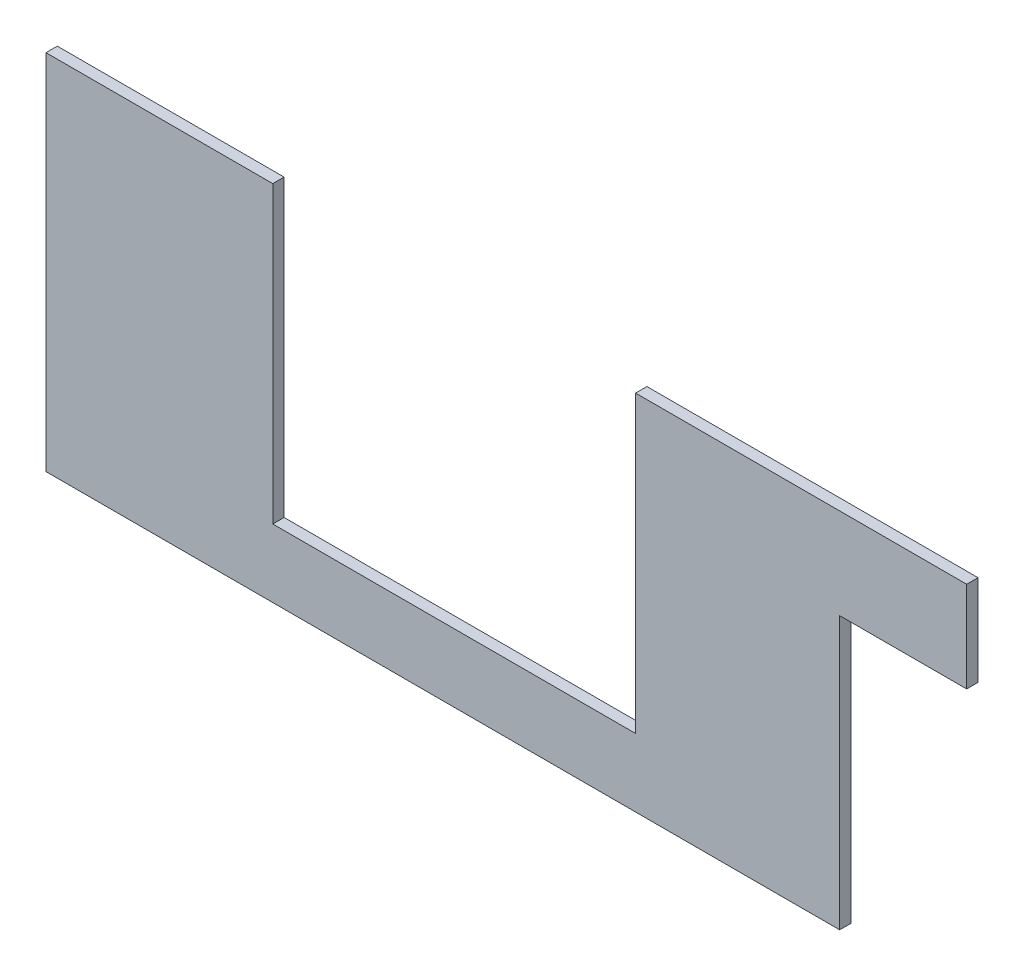
ISO-10303-21;
HEADER;
FILE_DESCRIPTION(('STEP AP214'),'2;1');
FILE_NAME('part.step','',(''),(''),'','','');
FILE_SCHEMA(('AUTOMOTIVE_DESIGN { 1 0 10303 214 1 1 1 1 }'));
ENDSEC;
DATA;
#1=APPLICATION_CONTEXT('core data for automotive mechanical design processes');
#2=APPLICATION_PROTOCOL_DEFINITION('international standard','automotive_design',2000,#1);
#3=PRODUCT_CONTEXT('',#1,'mechanical');
#4=PRODUCT('Part','Part','',(#3));
#5=PRODUCT_RELATED_PRODUCT_CATEGORY('part','',(#4));
#6=PRODUCT_DEFINITION_FORMATION('','',#4);
#7=PRODUCT_DEFINITION_CONTEXT('part definition',#1,'design');
#8=PRODUCT_DEFINITION('design','',#6,#7);
#9=PRODUCT_DEFINITION_SHAPE('','',#8);
#10=(LENGTH_UNIT() NAMED_UNIT(*) SI_UNIT(.MILLI.,.METRE.));
#11=(NAMED_UNIT(*) PLANE_ANGLE_UNIT() SI_UNIT($,.RADIAN.));
#12=(NAMED_UNIT(*) SI_UNIT($,.STERADIAN.) SOLID_ANGLE_UNIT());
#13=UNCERTAINTY_MEASURE_WITH_UNIT(LENGTH_MEASURE(1.E-05),#10,'distance_accuracy_value','');
#14=(GEOMETRIC_REPRESENTATION_CONTEXT(3) GLOBAL_UNCERTAINTY_ASSIGNED_CONTEXT((#13)) GLOBAL_UNIT_ASSIGNED_CONTEXT((#10,
#11,#12)) REPRESENTATION_CONTEXT('',''));
#15=CARTESIAN_POINT('',(0.,0.,0.));
#16=DIRECTION('',(0.,0.,1.));
#17=DIRECTION('',(1.,0.,0.));
#18=AXIS2_PLACEMENT_3D('',#15,#16,#17);
#19=CARTESIAN_POINT('',(0.,0.,3.175));
#20=DIRECTION('',(1.,0.,0.));
#21=DIRECTION('',(0.,0.,-1.));
#22=AXIS2_PLACEMENT_3D('',#19,#20,#21);
#23=PLANE('',#22);
#24=DIRECTION('',(0.,-1.,0.));
#25=VECTOR('',#24,1.);
#26=CARTESIAN_POINT('',(0.,0.,0.));
#27=LINE('',#26,#25);
#28=CARTESIAN_POINT('',(0.,101.6,0.));
#29=VERTEX_POINT('',#28);
#30=CARTESIAN_POINT('',(0.,0.,0.));
#31=VERTEX_POINT('',#30);
#32=EDGE_CURVE('E155',#29,#31,#27,.T.);
#33=ORIENTED_EDGE('',*,*,#32,.T.);
#34=DIRECTION('',(0.,0.,-1.));
#35=VECTOR('',#34,1.);
#36=CARTESIAN_POINT('',(0.,0.,3.175));
#37=LINE('',#36,#35);
#38=CARTESIAN_POINT('',(0.,0.,3.175));
#39=VERTEX_POINT('',#38);
#40=EDGE_CURVE('E11',#39,#31,#37,.T.);
#41=ORIENTED_EDGE('',*,*,#40,.F.);
#42=DIRECTION('',(0.,-1.,0.));
#43=VECTOR('',#42,1.);
#44=CARTESIAN_POINT('',(0.,0.,3.175));
#45=LINE('',#44,#43);
#46=CARTESIAN_POINT('',(0.,101.6,3.175));
#47=VERTEX_POINT('',#46);
#48=EDGE_CURVE('E183',#47,#39,#45,.T.);
#49=ORIENTED_EDGE('',*,*,#48,.F.);
#50=DIRECTION('',(0.,0.,-1.));
#51=VECTOR('',#50,1.);
#52=CARTESIAN_POINT('',(0.,101.6,3.175));
#53=LINE('',#52,#51);
#54=EDGE_CURVE('E151',#47,#29,#53,.T.);
#55=ORIENTED_EDGE('',*,*,#54,.T.);
#56=EDGE_LOOP('',(#33,#41,#49,#55));
#57=FACE_BOUND('',#56,.T.);
#58=ADVANCED_FACE('F42',(#57),#23,.F.);
#59=CARTESIAN_POINT('',(0.,0.,3.175));
#60=DIRECTION('',(0.,1.,0.));
#61=DIRECTION('',(0.,0.,1.));
#62=AXIS2_PLACEMENT_3D('',#59,#60,#61);
#63=PLANE('',#62);
#64=DIRECTION('',(1.,0.,0.));
#65=VECTOR('',#64,1.);
#66=CARTESIAN_POINT('',(0.,0.,0.));
#67=LINE('',#66,#65);
#68=CARTESIAN_POINT('',(222.25,0.,0.));
#69=VERTEX_POINT('',#68);
#70=EDGE_CURVE('E159',#31,#69,#67,.T.);
#71=ORIENTED_EDGE('',*,*,#70,.T.);
#72=DIRECTION('',(0.,0.,-1.));
#73=VECTOR('',#72,1.);
#74=CARTESIAN_POINT('',(222.25,0.,3.175));
#75=LINE('',#74,#73);
#76=CARTESIAN_POINT('',(222.25,0.,3.175));
#77=VERTEX_POINT('',#76);
#78=EDGE_CURVE('E51',#77,#69,#75,.T.);
#79=ORIENTED_EDGE('',*,*,#78,.F.);
#80=DIRECTION('',(1.,0.,0.));
#81=VECTOR('',#80,1.);
#82=CARTESIAN_POINT('',(0.,0.,3.175));
#83=LINE('',#82,#81);
#84=EDGE_CURVE('E108',#39,#77,#83,.T.);
#85=ORIENTED_EDGE('',*,*,#84,.F.);
#86=ORIENTED_EDGE('',*,*,#40,.T.);
#87=EDGE_LOOP('',(#71,#79,#85,#86));
#88=FACE_BOUND('',#87,.T.);
#89=ADVANCED_FACE('F247',(#88),#63,.F.);
#90=CARTESIAN_POINT('',(222.25,76.2,3.175));
#91=DIRECTION('',(-1.,0.,0.));
#92=DIRECTION('',(0.,0.,1.));
#93=AXIS2_PLACEMENT_3D('',#90,#91,#92);
#94=PLANE('',#93);
#95=DIRECTION('',(0.,1.,0.));
#96=VECTOR('',#95,1.);
#97=CARTESIAN_POINT('',(222.25,76.2,0.));
#98=LINE('',#97,#96);
#99=CARTESIAN_POINT('',(222.25,76.2,0.));
#100=VERTEX_POINT('',#99);
#101=EDGE_CURVE('E162',#69,#100,#98,.T.);
#102=ORIENTED_EDGE('',*,*,#101,.T.);
#103=DIRECTION('',(0.,0.,-1.));
#104=VECTOR('',#103,1.);
#105=CARTESIAN_POINT('',(222.25,76.2,3.175));
#106=LINE('',#105,#104);
#107=CARTESIAN_POINT('',(222.25,76.2,3.175));
#108=VERTEX_POINT('',#107);
#109=EDGE_CURVE('E202',#108,#100,#106,.T.);
#110=ORIENTED_EDGE('',*,*,#109,.F.);
#111=DIRECTION('',(0.,1.,0.));
#112=VECTOR('',#111,1.);
#113=CARTESIAN_POINT('',(222.25,76.2,3.175));
#114=LINE('',#113,#112);
#115=EDGE_CURVE('E212',#77,#108,#114,.T.);
#116=ORIENTED_EDGE('',*,*,#115,.F.);
#117=ORIENTED_EDGE('',*,*,#78,.T.);
#118=EDGE_LOOP('',(#102,#110,#116,#117));
#119=FACE_BOUND('',#118,.T.);
#120=ADVANCED_FACE('F210',(#119),#94,.F.);
#121=CARTESIAN_POINT('',(257.81,76.2,3.175));
#122=DIRECTION('',(0.,1.,0.));
#123=DIRECTION('',(-1.,0.,0.));
#124=AXIS2_PLACEMENT_3D('',#121,#122,#123);
#125=PLANE('',#124);
#126=DIRECTION('',(1.,0.,0.));
#127=VECTOR('',#126,1.);
#128=CARTESIAN_POINT('',(257.81,76.2,0.));
#129=LINE('',#128,#127);
#130=CARTESIAN_POINT('',(257.81,76.2,0.));
#131=VERTEX_POINT('',#130);
#132=EDGE_CURVE('E165',#100,#131,#129,.T.);
#133=ORIENTED_EDGE('',*,*,#132,.T.);
#134=DIRECTION('',(0.,0.,-1.));
#135=VECTOR('',#134,1.);
#136=CARTESIAN_POINT('',(257.81,76.2,3.175));
#137=LINE('',#136,#135);
#138=CARTESIAN_POINT('',(257.81,76.2,3.175));
#139=VERTEX_POINT('',#138);
#140=EDGE_CURVE('E198',#139,#131,#137,.T.);
#141=ORIENTED_EDGE('',*,*,#140,.F.);
#142=DIRECTION('',(1.,0.,0.));
#143=VECTOR('',#142,1.);
#144=CARTESIAN_POINT('',(257.81,76.2,3.175));
#145=LINE('',#144,#143);
#146=EDGE_CURVE('E231',#108,#139,#145,.T.);
#147=ORIENTED_EDGE('',*,*,#146,.F.);
#148=ORIENTED_EDGE('',*,*,#109,.T.);
#149=EDGE_LOOP('',(#133,#141,#147,#148));
#150=FACE_BOUND('',#149,.T.);
#151=ADVANCED_FACE('F221',(#150),#125,.F.);
#152=CARTESIAN_POINT('',(257.81,76.2,3.175));
#153=DIRECTION('',(-1.,0.,0.));
#154=DIRECTION('',(0.,0.,1.));
#155=AXIS2_PLACEMENT_3D('',#152,#153,#154);
#156=PLANE('',#155);
#157=DIRECTION('',(0.,1.,0.));
#158=VECTOR('',#157,1.);
#159=CARTESIAN_POINT('',(257.81,76.2,0.));
#160=LINE('',#159,#158);
#161=CARTESIAN_POINT('',(257.81,101.6,0.));
#162=VERTEX_POINT('',#161);
#163=EDGE_CURVE('E168',#131,#162,#160,.T.);
#164=ORIENTED_EDGE('',*,*,#163,.T.);
#165=DIRECTION('',(0.,0.,-1.));
#166=VECTOR('',#165,1.);
#167=CARTESIAN_POINT('',(257.81,101.6,3.175));
#168=LINE('',#167,#166);
#169=CARTESIAN_POINT('',(257.81,101.6,3.175));
#170=VERTEX_POINT('',#169);
#171=EDGE_CURVE('E194',#170,#162,#168,.T.);
#172=ORIENTED_EDGE('',*,*,#171,.F.);
#173=DIRECTION('',(0.,1.,0.));
#174=VECTOR('',#173,1.);
#175=CARTESIAN_POINT('',(257.81,76.2,3.175));
#176=LINE('',#175,#174);
#177=EDGE_CURVE('E227',#139,#170,#176,.T.);
#178=ORIENTED_EDGE('',*,*,#177,.F.);
#179=ORIENTED_EDGE('',*,*,#140,.T.);
#180=EDGE_LOOP('',(#164,#172,#178,#179));
#181=FACE_BOUND('',#180,.T.);
#182=ADVANCED_FACE('F225',(#181),#156,.F.);
#183=CARTESIAN_POINT('',(165.1,101.6,3.175));
#184=DIRECTION('',(0.,-1.,0.));
#185=DIRECTION('',(0.,0.,-1.));
#186=AXIS2_PLACEMENT_3D('',#183,#184,#185);
#187=PLANE('',#186);
#188=DIRECTION('',(-1.,0.,0.));
#189=VECTOR('',#188,1.);
#190=CARTESIAN_POINT('',(165.1,101.6,0.));
#191=LINE('',#190,#189);
#192=CARTESIAN_POINT('',(165.1,101.6,0.));
#193=VERTEX_POINT('',#192);
#194=EDGE_CURVE('E171',#162,#193,#191,.T.);
#195=ORIENTED_EDGE('',*,*,#194,.T.);
#196=DIRECTION('',(0.,0.,-1.));
#197=VECTOR('',#196,1.);
#198=CARTESIAN_POINT('',(165.1,101.6,3.175));
#199=LINE('',#198,#197);
#200=CARTESIAN_POINT('',(165.1,101.6,3.175));
#201=VERTEX_POINT('',#200);
#202=EDGE_CURVE('E190',#201,#193,#199,.T.);
#203=ORIENTED_EDGE('',*,*,#202,.F.);
#204=DIRECTION('',(-1.,0.,0.));
#205=VECTOR('',#204,1.);
#206=CARTESIAN_POINT('',(165.1,101.6,3.175));
#207=LINE('',#206,#205);
#208=EDGE_CURVE('E230',#170,#201,#207,.T.);
#209=ORIENTED_EDGE('',*,*,#208,.F.);
#210=ORIENTED_EDGE('',*,*,#171,.T.);
#211=EDGE_LOOP('',(#195,#203,#209,#210));
#212=FACE_BOUND('',#211,.T.);
#213=ADVANCED_FACE('F259',(#212),#187,.F.);
#214=CARTESIAN_POINT('',(165.1,19.05,3.175));
#215=DIRECTION('',(1.,0.,0.));
#216=DIRECTION('',(0.,0.,-1.));
#217=AXIS2_PLACEMENT_3D('',#214,#215,#216);
#218=PLANE('',#217);
#219=DIRECTION('',(0.,-1.,0.));
#220=VECTOR('',#219,1.);
#221=CARTESIAN_POINT('',(165.1,19.05,0.));
#222=LINE('',#221,#220);
#223=CARTESIAN_POINT('',(165.1,19.05,0.));
#224=VERTEX_POINT('',#223);
#225=EDGE_CURVE('E174',#193,#224,#222,.T.);
#226=ORIENTED_EDGE('',*,*,#225,.T.);
#227=DIRECTION('',(0.,0.,-1.));
#228=VECTOR('',#227,1.);
#229=CARTESIAN_POINT('',(165.1,19.05,3.175));
#230=LINE('',#229,#228);
#231=CARTESIAN_POINT('',(165.1,19.05,3.175));
#232=VERTEX_POINT('',#231);
#233=EDGE_CURVE('E144',#232,#224,#230,.T.);
#234=ORIENTED_EDGE('',*,*,#233,.F.);
#235=DIRECTION('',(0.,-1.,0.));
#236=VECTOR('',#235,1.);
#237=CARTESIAN_POINT('',(165.1,19.05,3.175));
#238=LINE('',#237,#236);
#239=EDGE_CURVE('E133',#201,#232,#238,.T.);
#240=ORIENTED_EDGE('',*,*,#239,.F.);
#241=ORIENTED_EDGE('',*,*,#202,.T.);
#242=EDGE_LOOP('',(#226,#234,#240,#241));
#243=FACE_BOUND('',#242,.T.);
#244=ADVANCED_FACE('F262',(#243),#218,.F.);
#245=CARTESIAN_POINT('',(63.5,19.05,3.175));
#246=DIRECTION('',(0.,-1.,0.));
#247=DIRECTION('',(0.,0.,-1.));
#248=AXIS2_PLACEMENT_3D('',#245,#246,#247);
#249=PLANE('',#248);
#250=DIRECTION('',(-1.,0.,0.));
#251=VECTOR('',#250,1.);
#252=CARTESIAN_POINT('',(63.5,19.05,0.));
#253=LINE('',#252,#251);
#254=CARTESIAN_POINT('',(63.5,19.05,0.));
#255=VERTEX_POINT('',#254);
#256=EDGE_CURVE('E142',#224,#255,#253,.T.);
#257=ORIENTED_EDGE('',*,*,#256,.T.);
#258=DIRECTION('',(0.,0.,-1.));
#259=VECTOR('',#258,1.);
#260=CARTESIAN_POINT('',(63.5,19.05,3.175));
#261=LINE('',#260,#259);
#262=CARTESIAN_POINT('',(63.5,19.05,3.175));
#263=VERTEX_POINT('',#262);
#264=EDGE_CURVE('E139',#263,#255,#261,.T.);
#265=ORIENTED_EDGE('',*,*,#264,.F.);
#266=DIRECTION('',(-1.,0.,0.));
#267=VECTOR('',#266,1.);
#268=CARTESIAN_POINT('',(63.5,19.05,3.175));
#269=LINE('',#268,#267);
#270=EDGE_CURVE('E127',#232,#263,#269,.T.);
#271=ORIENTED_EDGE('',*,*,#270,.F.);
#272=ORIENTED_EDGE('',*,*,#233,.T.);
#273=EDGE_LOOP('',(#257,#265,#271,#272));
#274=FACE_BOUND('',#273,.T.);
#275=ADVANCED_FACE('F140',(#274),#249,.F.);
#276=CARTESIAN_POINT('',(63.5,101.6,3.175));
#277=DIRECTION('',(-1.,0.,0.));
#278=DIRECTION('',(0.,-1.,0.));
#279=AXIS2_PLACEMENT_3D('',#276,#277,#278);
#280=PLANE('',#279);
#281=DIRECTION('',(0.,1.,0.));
#282=VECTOR('',#281,1.);
#283=CARTESIAN_POINT('',(63.5,101.6,0.));
#284=LINE('',#283,#282);
#285=CARTESIAN_POINT('',(63.5,101.6,0.));
#286=VERTEX_POINT('',#285);
#287=EDGE_CURVE('E94',#255,#286,#284,.T.);
#288=ORIENTED_EDGE('',*,*,#287,.T.);
#289=DIRECTION('',(0.,0.,-1.));
#290=VECTOR('',#289,1.);
#291=CARTESIAN_POINT('',(63.5,101.6,3.175));
#292=LINE('',#291,#290);
#293=CARTESIAN_POINT('',(63.5,101.6,3.175));
#294=VERTEX_POINT('',#293);
#295=EDGE_CURVE('E145',#294,#286,#292,.T.);
#296=ORIENTED_EDGE('',*,*,#295,.F.);
#297=DIRECTION('',(0.,1.,0.));
#298=VECTOR('',#297,1.);
#299=CARTESIAN_POINT('',(63.5,101.6,3.175));
#300=LINE('',#299,#298);
#301=EDGE_CURVE('E131',#263,#294,#300,.T.);
#302=ORIENTED_EDGE('',*,*,#301,.F.);
#303=ORIENTED_EDGE('',*,*,#264,.T.);
#304=EDGE_LOOP('',(#288,#296,#302,#303));
#305=FACE_BOUND('',#304,.T.);
#306=ADVANCED_FACE('F147',(#305),#280,.F.);
#307=CARTESIAN_POINT('',(0.,101.6,3.175));
#308=DIRECTION('',(0.,-1.,0.));
#309=DIRECTION('',(0.,0.,-1.));
#310=AXIS2_PLACEMENT_3D('',#307,#308,#309);
#311=PLANE('',#310);
#312=DIRECTION('',(-1.,0.,0.));
#313=VECTOR('',#312,1.);
#314=CARTESIAN_POINT('',(0.,101.6,0.));
#315=LINE('',#314,#313);
#316=EDGE_CURVE('E100',#286,#29,#315,.T.);
#317=ORIENTED_EDGE('',*,*,#316,.T.);
#318=ORIENTED_EDGE('',*,*,#54,.F.);
#319=DIRECTION('',(-1.,0.,0.));
#320=VECTOR('',#319,1.);
#321=CARTESIAN_POINT('',(0.,101.6,3.175));
#322=LINE('',#321,#320);
#323=EDGE_CURVE('E59',#294,#47,#322,.T.);
#324=ORIENTED_EDGE('',*,*,#323,.F.);
#325=ORIENTED_EDGE('',*,*,#295,.T.);
#326=EDGE_LOOP('',(#317,#318,#324,#325));
#327=FACE_BOUND('',#326,.T.);
#328=ADVANCED_FACE('F271',(#327),#311,.F.);
#329=CARTESIAN_POINT('',(0.,0.,3.175));
#330=DIRECTION('',(0.,0.,-1.));
#331=DIRECTION('',(-1.,0.,0.));
#332=AXIS2_PLACEMENT_3D('',#329,#330,#331);
#333=PLANE('',#332);
#334=ORIENTED_EDGE('',*,*,#48,.T.);
#335=ORIENTED_EDGE('',*,*,#84,.T.);
#336=ORIENTED_EDGE('',*,*,#115,.T.);
#337=ORIENTED_EDGE('',*,*,#146,.T.);
#338=ORIENTED_EDGE('',*,*,#177,.T.);
#339=ORIENTED_EDGE('',*,*,#208,.T.);
#340=ORIENTED_EDGE('',*,*,#239,.T.);
#341=ORIENTED_EDGE('',*,*,#270,.T.);
#342=ORIENTED_EDGE('',*,*,#301,.T.);
#343=ORIENTED_EDGE('',*,*,#323,.T.);
#344=EDGE_LOOP('',(#334,#335,#336,#337,#338,#339,#340,#341,#342,#343));
#345=FACE_BOUND('',#344,.T.);
#346=ADVANCED_FACE('F129',(#345),#333,.F.);
#347=CARTESIAN_POINT('',(0.,0.,0.));
#348=DIRECTION('',(0.,0.,-1.));
#349=DIRECTION('',(-1.,0.,0.));
#350=AXIS2_PLACEMENT_3D('',#347,#348,#349);
#351=PLANE('',#350);
#352=ORIENTED_EDGE('',*,*,#32,.F.);
#353=ORIENTED_EDGE('',*,*,#316,.F.);
#354=ORIENTED_EDGE('',*,*,#287,.F.);
#355=ORIENTED_EDGE('',*,*,#256,.F.);
#356=ORIENTED_EDGE('',*,*,#225,.F.);
#357=ORIENTED_EDGE('',*,*,#194,.F.);
#358=ORIENTED_EDGE('',*,*,#163,.F.);
#359=ORIENTED_EDGE('',*,*,#132,.F.);
#360=ORIENTED_EDGE('',*,*,#101,.F.);
#361=ORIENTED_EDGE('',*,*,#70,.F.);
#362=EDGE_LOOP('',(#352,#353,#354,#355,#356,#357,#358,#359,#360,#361));
#363=FACE_BOUND('',#362,.T.);
#364=ADVANCED_FACE('F216',(#363),#351,.T.);
#365=CLOSED_SHELL('',(#58,#89,#120,#151,#182,#213,#244,#275,#306,#328,#346,#364));
#366=MANIFOLD_SOLID_BREP('B2',#365);
#367=ADVANCED_BREP_SHAPE_REPRESENTATION('',(#18,#366),#14);
#368=SHAPE_DEFINITION_REPRESENTATION(#9,#367);
ENDSEC;
END-ISO-10303-21;
